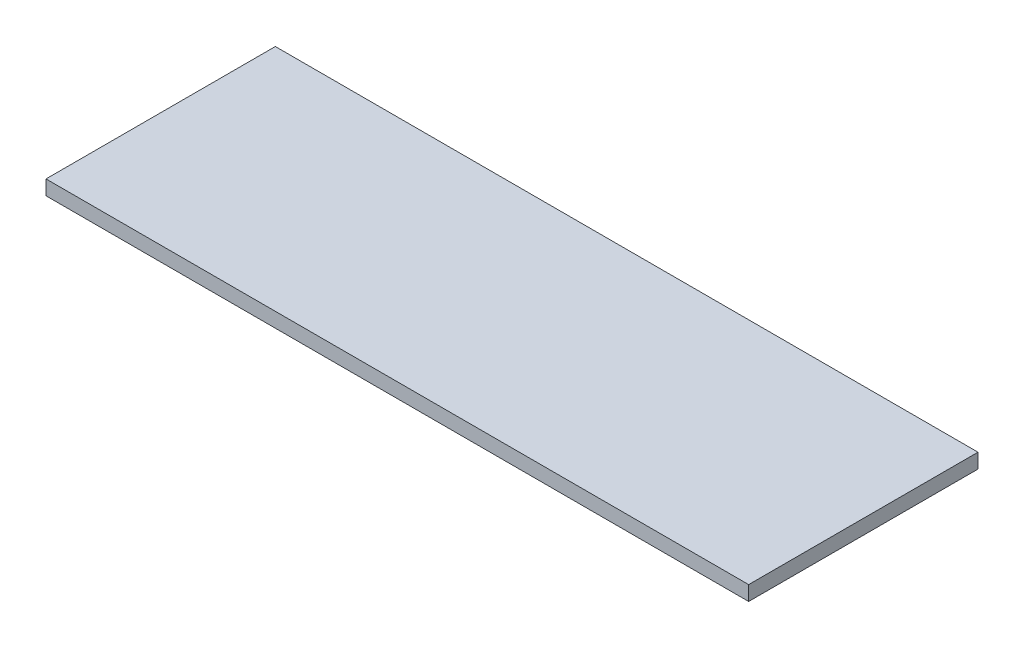
ISO-10303-21;
HEADER;
FILE_DESCRIPTION(('STEP AP214'),'2;1');
FILE_NAME('part.step','',(''),(''),'','','');
FILE_SCHEMA(('AUTOMOTIVE_DESIGN { 1 0 10303 214 1 1 1 1 }'));
ENDSEC;
DATA;
#1=APPLICATION_CONTEXT('core data for automotive mechanical design processes');
#2=APPLICATION_PROTOCOL_DEFINITION('international standard','automotive_design',2000,#1);
#3=PRODUCT_CONTEXT('',#1,'mechanical');
#4=PRODUCT('Part','Part','',(#3));
#5=PRODUCT_RELATED_PRODUCT_CATEGORY('part','',(#4));
#6=PRODUCT_DEFINITION_FORMATION('','',#4);
#7=PRODUCT_DEFINITION_CONTEXT('part definition',#1,'design');
#8=PRODUCT_DEFINITION('design','',#6,#7);
#9=PRODUCT_DEFINITION_SHAPE('','',#8);
#10=(LENGTH_UNIT() NAMED_UNIT(*) SI_UNIT(.MILLI.,.METRE.));
#11=(NAMED_UNIT(*) PLANE_ANGLE_UNIT() SI_UNIT($,.RADIAN.));
#12=(NAMED_UNIT(*) SI_UNIT($,.STERADIAN.) SOLID_ANGLE_UNIT());
#13=UNCERTAINTY_MEASURE_WITH_UNIT(LENGTH_MEASURE(1.E-05),#10,'distance_accuracy_value','');
#14=(GEOMETRIC_REPRESENTATION_CONTEXT(3) GLOBAL_UNCERTAINTY_ASSIGNED_CONTEXT((#13)) GLOBAL_UNIT_ASSIGNED_CONTEXT((#10,
#11,#12)) REPRESENTATION_CONTEXT('',''));
#15=CARTESIAN_POINT('',(0.,0.,0.));
#16=DIRECTION('',(0.,0.,1.));
#17=DIRECTION('',(1.,0.,0.));
#18=AXIS2_PLACEMENT_3D('',#15,#16,#17);
#19=CARTESIAN_POINT('',(0.,6.,0.));
#20=DIRECTION('',(1.,0.,0.));
#21=DIRECTION('',(0.,0.,-1.));
#22=AXIS2_PLACEMENT_3D('',#19,#20,#21);
#23=PLANE('',#22);
#24=DIRECTION('',(0.,0.,1.));
#25=VECTOR('',#24,1.);
#26=CARTESIAN_POINT('',(0.,0.,0.));
#27=LINE('',#26,#25);
#28=CARTESIAN_POINT('',(0.,0.,-94.));
#29=VERTEX_POINT('',#28);
#30=CARTESIAN_POINT('',(0.,0.,0.));
#31=VERTEX_POINT('',#30);
#32=EDGE_CURVE('E99',#29,#31,#27,.T.);
#33=ORIENTED_EDGE('',*,*,#32,.T.);
#34=DIRECTION('',(0.,-1.,0.));
#35=VECTOR('',#34,1.);
#36=CARTESIAN_POINT('',(0.,6.,0.));
#37=LINE('',#36,#35);
#38=CARTESIAN_POINT('',(0.,6.,0.));
#39=VERTEX_POINT('',#38);
#40=EDGE_CURVE('E11',#39,#31,#37,.T.);
#41=ORIENTED_EDGE('',*,*,#40,.F.);
#42=DIRECTION('',(0.,0.,1.));
#43=VECTOR('',#42,1.);
#44=CARTESIAN_POINT('',(0.,6.,0.));
#45=LINE('',#44,#43);
#46=CARTESIAN_POINT('',(0.,6.,-94.));
#47=VERTEX_POINT('',#46);
#48=EDGE_CURVE('E87',#47,#39,#45,.T.);
#49=ORIENTED_EDGE('',*,*,#48,.F.);
#50=DIRECTION('',(0.,-1.,0.));
#51=VECTOR('',#50,1.);
#52=CARTESIAN_POINT('',(0.,6.,-94.));
#53=LINE('',#52,#51);
#54=EDGE_CURVE('E95',#47,#29,#53,.T.);
#55=ORIENTED_EDGE('',*,*,#54,.T.);
#56=EDGE_LOOP('',(#33,#41,#49,#55));
#57=FACE_BOUND('',#56,.T.);
#58=ADVANCED_FACE('F36',(#57),#23,.F.);
#59=CARTESIAN_POINT('',(0.,6.,0.));
#60=DIRECTION('',(0.,0.,-1.));
#61=DIRECTION('',(-1.,0.,0.));
#62=AXIS2_PLACEMENT_3D('',#59,#60,#61);
#63=PLANE('',#62);
#64=DIRECTION('',(1.,0.,0.));
#65=VECTOR('',#64,1.);
#66=CARTESIAN_POINT('',(0.,0.,0.));
#67=LINE('',#66,#65);
#68=CARTESIAN_POINT('',(288.,0.,0.));
#69=VERTEX_POINT('',#68);
#70=EDGE_CURVE('E91',#31,#69,#67,.T.);
#71=ORIENTED_EDGE('',*,*,#70,.T.);
#72=DIRECTION('',(0.,-1.,0.));
#73=VECTOR('',#72,1.);
#74=CARTESIAN_POINT('',(288.,6.,0.));
#75=LINE('',#74,#73);
#76=CARTESIAN_POINT('',(288.,6.,0.));
#77=VERTEX_POINT('',#76);
#78=EDGE_CURVE('E44',#77,#69,#75,.T.);
#79=ORIENTED_EDGE('',*,*,#78,.F.);
#80=DIRECTION('',(1.,0.,0.));
#81=VECTOR('',#80,1.);
#82=CARTESIAN_POINT('',(0.,6.,0.));
#83=LINE('',#82,#81);
#84=EDGE_CURVE('E82',#39,#77,#83,.T.);
#85=ORIENTED_EDGE('',*,*,#84,.F.);
#86=ORIENTED_EDGE('',*,*,#40,.T.);
#87=EDGE_LOOP('',(#71,#79,#85,#86));
#88=FACE_BOUND('',#87,.T.);
#89=ADVANCED_FACE('F90',(#88),#63,.F.);
#90=CARTESIAN_POINT('',(288.,6.,0.));
#91=DIRECTION('',(-1.,0.,0.));
#92=DIRECTION('',(0.,0.,1.));
#93=AXIS2_PLACEMENT_3D('',#90,#91,#92);
#94=PLANE('',#93);
#95=DIRECTION('',(0.,0.,-1.));
#96=VECTOR('',#95,1.);
#97=CARTESIAN_POINT('',(288.,0.,0.));
#98=LINE('',#97,#96);
#99=CARTESIAN_POINT('',(288.,0.,-94.));
#100=VERTEX_POINT('',#99);
#101=EDGE_CURVE('E69',#69,#100,#98,.T.);
#102=ORIENTED_EDGE('',*,*,#101,.T.);
#103=DIRECTION('',(0.,-1.,0.));
#104=VECTOR('',#103,1.);
#105=CARTESIAN_POINT('',(288.,6.,-94.));
#106=LINE('',#105,#104);
#107=CARTESIAN_POINT('',(288.,6.,-94.));
#108=VERTEX_POINT('',#107);
#109=EDGE_CURVE('E92',#108,#100,#106,.T.);
#110=ORIENTED_EDGE('',*,*,#109,.F.);
#111=DIRECTION('',(0.,0.,-1.));
#112=VECTOR('',#111,1.);
#113=CARTESIAN_POINT('',(288.,6.,0.));
#114=LINE('',#113,#112);
#115=EDGE_CURVE('E85',#77,#108,#114,.T.);
#116=ORIENTED_EDGE('',*,*,#115,.F.);
#117=ORIENTED_EDGE('',*,*,#78,.T.);
#118=EDGE_LOOP('',(#102,#110,#116,#117));
#119=FACE_BOUND('',#118,.T.);
#120=ADVANCED_FACE('F93',(#119),#94,.F.);
#121=CARTESIAN_POINT('',(0.,6.,-94.));
#122=DIRECTION('',(0.,0.,1.));
#123=DIRECTION('',(1.,0.,0.));
#124=AXIS2_PLACEMENT_3D('',#121,#122,#123);
#125=PLANE('',#124);
#126=DIRECTION('',(-1.,0.,0.));
#127=VECTOR('',#126,1.);
#128=CARTESIAN_POINT('',(0.,0.,-94.));
#129=LINE('',#128,#127);
#130=EDGE_CURVE('E75',#100,#29,#129,.T.);
#131=ORIENTED_EDGE('',*,*,#130,.T.);
#132=ORIENTED_EDGE('',*,*,#54,.F.);
#133=DIRECTION('',(-1.,0.,0.));
#134=VECTOR('',#133,1.);
#135=CARTESIAN_POINT('',(0.,6.,-94.));
#136=LINE('',#135,#134);
#137=EDGE_CURVE('E52',#108,#47,#136,.T.);
#138=ORIENTED_EDGE('',*,*,#137,.F.);
#139=ORIENTED_EDGE('',*,*,#109,.T.);
#140=EDGE_LOOP('',(#131,#132,#138,#139));
#141=FACE_BOUND('',#140,.T.);
#142=ADVANCED_FACE('F106',(#141),#125,.F.);
#143=CARTESIAN_POINT('',(0.,6.,0.));
#144=DIRECTION('',(0.,-1.,0.));
#145=DIRECTION('',(0.,0.,-1.));
#146=AXIS2_PLACEMENT_3D('',#143,#144,#145);
#147=PLANE('',#146);
#148=ORIENTED_EDGE('',*,*,#48,.T.);
#149=ORIENTED_EDGE('',*,*,#84,.T.);
#150=ORIENTED_EDGE('',*,*,#115,.T.);
#151=ORIENTED_EDGE('',*,*,#137,.T.);
#152=EDGE_LOOP('',(#148,#149,#150,#151));
#153=FACE_BOUND('',#152,.T.);
#154=ADVANCED_FACE('F83',(#153),#147,.F.);
#155=CARTESIAN_POINT('',(0.,0.,0.));
#156=DIRECTION('',(0.,-1.,0.));
#157=DIRECTION('',(0.,0.,-1.));
#158=AXIS2_PLACEMENT_3D('',#155,#156,#157);
#159=PLANE('',#158);
#160=ORIENTED_EDGE('',*,*,#32,.F.);
#161=ORIENTED_EDGE('',*,*,#130,.F.);
#162=ORIENTED_EDGE('',*,*,#101,.F.);
#163=ORIENTED_EDGE('',*,*,#70,.F.);
#164=EDGE_LOOP('',(#160,#161,#162,#163));
#165=FACE_BOUND('',#164,.T.);
#166=ADVANCED_FACE('F109',(#165),#159,.T.);
#167=CLOSED_SHELL('',(#58,#89,#120,#142,#154,#166));
#168=MANIFOLD_SOLID_BREP('B2',#167);
#169=ADVANCED_BREP_SHAPE_REPRESENTATION('',(#18,#168),#14);
#170=SHAPE_DEFINITION_REPRESENTATION(#9,#169);
ENDSEC;
END-ISO-10303-21;
